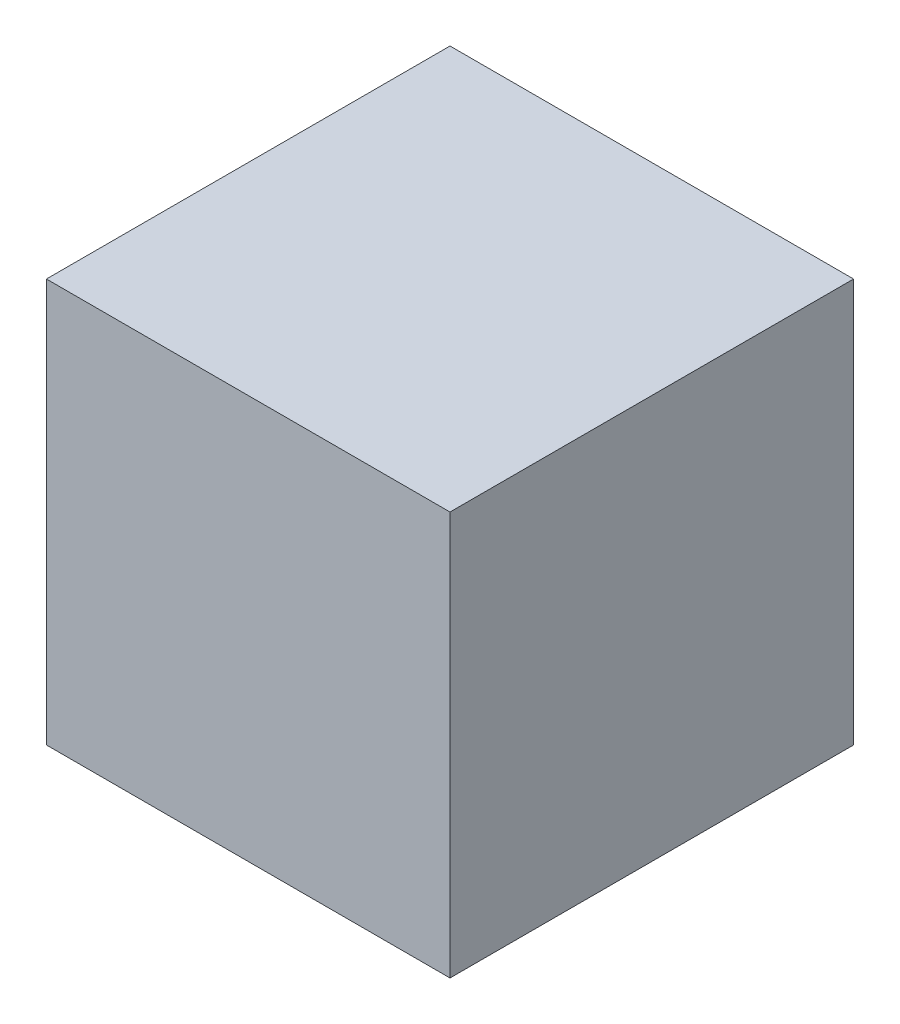
ISO-10303-21;
HEADER;
FILE_DESCRIPTION(('STEP AP214'),'2;1');
FILE_NAME('part.step','',(''),(''),'','','');
FILE_SCHEMA(('AUTOMOTIVE_DESIGN { 1 0 10303 214 1 1 1 1 }'));
ENDSEC;
DATA;
#1=APPLICATION_CONTEXT('core data for automotive mechanical design processes');
#2=APPLICATION_PROTOCOL_DEFINITION('international standard','automotive_design',2000,#1);
#3=PRODUCT_CONTEXT('',#1,'mechanical');
#4=PRODUCT('Part','Part','',(#3));
#5=PRODUCT_RELATED_PRODUCT_CATEGORY('part','',(#4));
#6=PRODUCT_DEFINITION_FORMATION('','',#4);
#7=PRODUCT_DEFINITION_CONTEXT('part definition',#1,'design');
#8=PRODUCT_DEFINITION('design','',#6,#7);
#9=PRODUCT_DEFINITION_SHAPE('','',#8);
#10=(LENGTH_UNIT() NAMED_UNIT(*) SI_UNIT(.MILLI.,.METRE.));
#11=(NAMED_UNIT(*) PLANE_ANGLE_UNIT() SI_UNIT($,.RADIAN.));
#12=(NAMED_UNIT(*) SI_UNIT($,.STERADIAN.) SOLID_ANGLE_UNIT());
#13=UNCERTAINTY_MEASURE_WITH_UNIT(LENGTH_MEASURE(1.E-05),#10,'distance_accuracy_value','');
#14=(GEOMETRIC_REPRESENTATION_CONTEXT(3) GLOBAL_UNCERTAINTY_ASSIGNED_CONTEXT((#13)) GLOBAL_UNIT_ASSIGNED_CONTEXT((#10,
#11,#12)) REPRESENTATION_CONTEXT('',''));
#15=CARTESIAN_POINT('',(0.,0.,0.));
#16=DIRECTION('',(0.,0.,1.));
#17=DIRECTION('',(1.,0.,0.));
#18=AXIS2_PLACEMENT_3D('',#15,#16,#17);
#19=CARTESIAN_POINT('',(100.,100.,200.));
#20=DIRECTION('',(-1.,0.,0.));
#21=DIRECTION('',(0.,0.,1.));
#22=AXIS2_PLACEMENT_3D('',#19,#20,#21);
#23=PLANE('',#22);
#24=DIRECTION('',(0.,1.,0.));
#25=VECTOR('',#24,1.);
#26=CARTESIAN_POINT('',(100.,100.,0.));
#27=LINE('',#26,#25);
#28=CARTESIAN_POINT('',(100.,-100.,0.));
#29=VERTEX_POINT('',#28);
#30=CARTESIAN_POINT('',(100.,100.,0.));
#31=VERTEX_POINT('',#30);
#32=EDGE_CURVE('E107',#29,#31,#27,.T.);
#33=ORIENTED_EDGE('',*,*,#32,.T.);
#34=DIRECTION('',(0.,0.,-1.));
#35=VECTOR('',#34,1.);
#36=CARTESIAN_POINT('',(100.,100.,200.));
#37=LINE('',#36,#35);
#38=CARTESIAN_POINT('',(100.,100.,200.));
#39=VERTEX_POINT('',#38);
#40=EDGE_CURVE('E11',#39,#31,#37,.T.);
#41=ORIENTED_EDGE('',*,*,#40,.F.);
#42=DIRECTION('',(0.,1.,0.));
#43=VECTOR('',#42,1.);
#44=CARTESIAN_POINT('',(100.,100.,200.));
#45=LINE('',#44,#43);
#46=CARTESIAN_POINT('',(100.,-100.,200.));
#47=VERTEX_POINT('',#46);
#48=EDGE_CURVE('E91',#47,#39,#45,.T.);
#49=ORIENTED_EDGE('',*,*,#48,.F.);
#50=DIRECTION('',(0.,0.,-1.));
#51=VECTOR('',#50,1.);
#52=CARTESIAN_POINT('',(100.,-100.,200.));
#53=LINE('',#52,#51);
#54=EDGE_CURVE('E103',#47,#29,#53,.T.);
#55=ORIENTED_EDGE('',*,*,#54,.T.);
#56=EDGE_LOOP('',(#33,#41,#49,#55));
#57=FACE_BOUND('',#56,.T.);
#58=ADVANCED_FACE('F39',(#57),#23,.F.);
#59=CARTESIAN_POINT('',(-100.,100.,200.));
#60=DIRECTION('',(0.,-1.,0.));
#61=DIRECTION('',(0.,0.,-1.));
#62=AXIS2_PLACEMENT_3D('',#59,#60,#61);
#63=PLANE('',#62);
#64=DIRECTION('',(-1.,0.,0.));
#65=VECTOR('',#64,1.);
#66=CARTESIAN_POINT('',(-100.,100.,0.));
#67=LINE('',#66,#65);
#68=CARTESIAN_POINT('',(-100.,100.,0.));
#69=VERTEX_POINT('',#68);
#70=EDGE_CURVE('E96',#31,#69,#67,.T.);
#71=ORIENTED_EDGE('',*,*,#70,.T.);
#72=DIRECTION('',(0.,0.,-1.));
#73=VECTOR('',#72,1.);
#74=CARTESIAN_POINT('',(-100.,100.,200.));
#75=LINE('',#74,#73);
#76=CARTESIAN_POINT('',(-100.,100.,200.));
#77=VERTEX_POINT('',#76);
#78=EDGE_CURVE('E48',#77,#69,#75,.T.);
#79=ORIENTED_EDGE('',*,*,#78,.F.);
#80=DIRECTION('',(-1.,0.,0.));
#81=VECTOR('',#80,1.);
#82=CARTESIAN_POINT('',(-100.,100.,200.));
#83=LINE('',#82,#81);
#84=EDGE_CURVE('E86',#39,#77,#83,.T.);
#85=ORIENTED_EDGE('',*,*,#84,.F.);
#86=ORIENTED_EDGE('',*,*,#40,.T.);
#87=EDGE_LOOP('',(#71,#79,#85,#86));
#88=FACE_BOUND('',#87,.T.);
#89=ADVANCED_FACE('F95',(#88),#63,.F.);
#90=CARTESIAN_POINT('',(-100.,100.,200.));
#91=DIRECTION('',(1.,0.,0.));
#92=DIRECTION('',(0.,0.,-1.));
#93=AXIS2_PLACEMENT_3D('',#90,#91,#92);
#94=PLANE('',#93);
#95=DIRECTION('',(0.,-1.,0.));
#96=VECTOR('',#95,1.);
#97=CARTESIAN_POINT('',(-100.,100.,0.));
#98=LINE('',#97,#96);
#99=CARTESIAN_POINT('',(-100.,-100.,0.));
#100=VERTEX_POINT('',#99);
#101=EDGE_CURVE('E73',#69,#100,#98,.T.);
#102=ORIENTED_EDGE('',*,*,#101,.T.);
#103=DIRECTION('',(0.,0.,-1.));
#104=VECTOR('',#103,1.);
#105=CARTESIAN_POINT('',(-100.,-100.,200.));
#106=LINE('',#105,#104);
#107=CARTESIAN_POINT('',(-100.,-100.,200.));
#108=VERTEX_POINT('',#107);
#109=EDGE_CURVE('E98',#108,#100,#106,.T.);
#110=ORIENTED_EDGE('',*,*,#109,.F.);
#111=DIRECTION('',(0.,-1.,0.));
#112=VECTOR('',#111,1.);
#113=CARTESIAN_POINT('',(-100.,100.,200.));
#114=LINE('',#113,#112);
#115=EDGE_CURVE('E89',#77,#108,#114,.T.);
#116=ORIENTED_EDGE('',*,*,#115,.F.);
#117=ORIENTED_EDGE('',*,*,#78,.T.);
#118=EDGE_LOOP('',(#102,#110,#116,#117));
#119=FACE_BOUND('',#118,.T.);
#120=ADVANCED_FACE('F99',(#119),#94,.F.);
#121=CARTESIAN_POINT('',(-100.,-100.,200.));
#122=DIRECTION('',(0.,1.,0.));
#123=DIRECTION('',(0.,0.,1.));
#124=AXIS2_PLACEMENT_3D('',#121,#122,#123);
#125=PLANE('',#124);
#126=DIRECTION('',(1.,0.,0.));
#127=VECTOR('',#126,1.);
#128=CARTESIAN_POINT('',(-100.,-100.,0.));
#129=LINE('',#128,#127);
#130=EDGE_CURVE('E79',#100,#29,#129,.T.);
#131=ORIENTED_EDGE('',*,*,#130,.T.);
#132=ORIENTED_EDGE('',*,*,#54,.F.);
#133=DIRECTION('',(1.,0.,0.));
#134=VECTOR('',#133,1.);
#135=CARTESIAN_POINT('',(-100.,-100.,200.));
#136=LINE('',#135,#134);
#137=EDGE_CURVE('E56',#108,#47,#136,.T.);
#138=ORIENTED_EDGE('',*,*,#137,.F.);
#139=ORIENTED_EDGE('',*,*,#109,.T.);
#140=EDGE_LOOP('',(#131,#132,#138,#139));
#141=FACE_BOUND('',#140,.T.);
#142=ADVANCED_FACE('F120',(#141),#125,.F.);
#143=CARTESIAN_POINT('',(0.,0.,200.));
#144=DIRECTION('',(0.,0.,1.));
#145=DIRECTION('',(1.,0.,0.));
#146=AXIS2_PLACEMENT_3D('',#143,#144,#145);
#147=PLANE('',#146);
#148=ORIENTED_EDGE('',*,*,#48,.T.);
#149=ORIENTED_EDGE('',*,*,#84,.T.);
#150=ORIENTED_EDGE('',*,*,#115,.T.);
#151=ORIENTED_EDGE('',*,*,#137,.T.);
#152=EDGE_LOOP('',(#148,#149,#150,#151));
#153=FACE_BOUND('',#152,.T.);
#154=ADVANCED_FACE('F87',(#153),#147,.T.);
#155=CARTESIAN_POINT('',(0.,0.,0.));
#156=DIRECTION('',(0.,0.,1.));
#157=DIRECTION('',(1.,0.,0.));
#158=AXIS2_PLACEMENT_3D('',#155,#156,#157);
#159=PLANE('',#158);
#160=ORIENTED_EDGE('',*,*,#32,.F.);
#161=ORIENTED_EDGE('',*,*,#130,.F.);
#162=ORIENTED_EDGE('',*,*,#101,.F.);
#163=ORIENTED_EDGE('',*,*,#70,.F.);
#164=EDGE_LOOP('',(#160,#161,#162,#163));
#165=FACE_BOUND('',#164,.T.);
#166=ADVANCED_FACE('F123',(#165),#159,.F.);
#167=CLOSED_SHELL('',(#58,#89,#120,#142,#154,#166));
#168=MANIFOLD_SOLID_BREP('B2',#167);
#169=ADVANCED_BREP_SHAPE_REPRESENTATION('',(#18,#168),#14);
#170=SHAPE_DEFINITION_REPRESENTATION(#9,#169);
ENDSEC;
END-ISO-10303-21;
